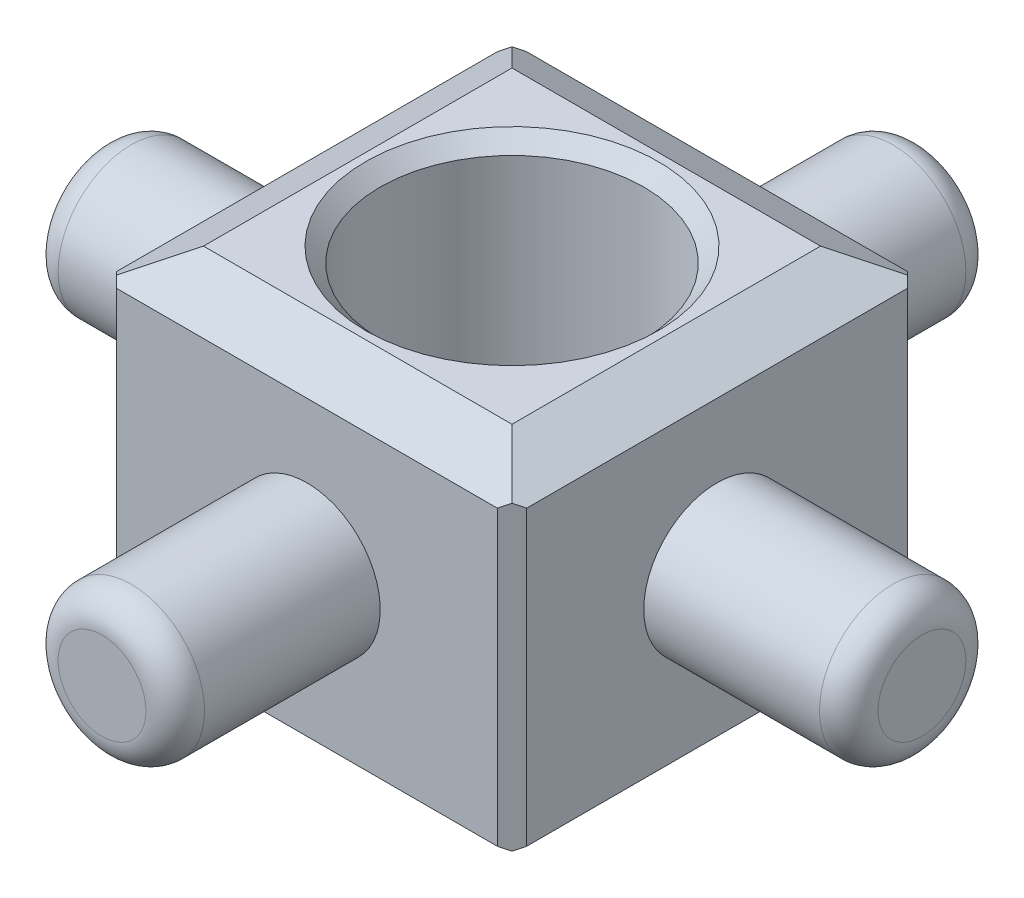
ISO-10303-21;
HEADER;
FILE_DESCRIPTION(('STEP AP214'),'2;1');
FILE_NAME('part.step','',(''),(''),'','','');
FILE_SCHEMA(('AUTOMOTIVE_DESIGN { 1 0 10303 214 1 1 1 1 }'));
ENDSEC;
DATA;
#1=APPLICATION_CONTEXT('core data for automotive mechanical design processes');
#2=APPLICATION_PROTOCOL_DEFINITION('international standard','automotive_design',2000,#1);
#3=PRODUCT_CONTEXT('',#1,'mechanical');
#4=PRODUCT('Part','Part','',(#3));
#5=PRODUCT_RELATED_PRODUCT_CATEGORY('part','',(#4));
#6=PRODUCT_DEFINITION_FORMATION('','',#4);
#7=PRODUCT_DEFINITION_CONTEXT('part definition',#1,'design');
#8=PRODUCT_DEFINITION('design','',#6,#7);
#9=PRODUCT_DEFINITION_SHAPE('','',#8);
#10=(LENGTH_UNIT() NAMED_UNIT(*) SI_UNIT(.MILLI.,.METRE.));
#11=(NAMED_UNIT(*) PLANE_ANGLE_UNIT() SI_UNIT($,.RADIAN.));
#12=(NAMED_UNIT(*) SI_UNIT($,.STERADIAN.) SOLID_ANGLE_UNIT());
#13=UNCERTAINTY_MEASURE_WITH_UNIT(LENGTH_MEASURE(1.E-05),#10,'distance_accuracy_value','');
#14=(GEOMETRIC_REPRESENTATION_CONTEXT(3) GLOBAL_UNCERTAINTY_ASSIGNED_CONTEXT((#13)) GLOBAL_UNIT_ASSIGNED_CONTEXT((#10,
#11,#12)) REPRESENTATION_CONTEXT('',''));
#15=CARTESIAN_POINT('',(0.,0.,0.));
#16=DIRECTION('',(0.,0.,1.));
#17=DIRECTION('',(1.,0.,0.));
#18=AXIS2_PLACEMENT_3D('',#15,#16,#17);
#19=CARTESIAN_POINT('',(-3.5,6.,-3.5));
#20=DIRECTION('',(0.,0.,1.));
#21=DIRECTION('',(1.,0.,0.));
#22=AXIS2_PLACEMENT_3D('',#19,#20,#21);
#23=PLANE('',#22);
#24=DIRECTION('',(0.,-1.,0.));
#25=VECTOR('',#24,1.);
#26=CARTESIAN_POINT('',(3.25,6.,-3.5));
#27=LINE('',#26,#25);
#28=CARTESIAN_POINT('',(3.25,5.5,-3.5));
#29=VERTEX_POINT('',#28);
#30=CARTESIAN_POINT('',(3.25,0.500000000000002,-3.5));
#31=VERTEX_POINT('',#30);
#32=EDGE_CURVE('E170',#29,#31,#27,.T.);
#33=ORIENTED_EDGE('',*,*,#32,.T.);
#34=DIRECTION('',(-1.,0.,0.));
#35=VECTOR('',#34,1.);
#36=CARTESIAN_POINT('',(-3.5,0.500000000000002,-3.5));
#37=LINE('',#36,#35);
#38=CARTESIAN_POINT('',(-3.25,0.500000000000002,-3.5));
#39=VERTEX_POINT('',#38);
#40=EDGE_CURVE('E211',#31,#39,#37,.T.);
#41=ORIENTED_EDGE('',*,*,#40,.T.);
#42=DIRECTION('',(0.,1.,0.));
#43=VECTOR('',#42,1.);
#44=CARTESIAN_POINT('',(-3.25,6.,-3.5));
#45=LINE('',#44,#43);
#46=CARTESIAN_POINT('',(-3.25,5.5,-3.5));
#47=VERTEX_POINT('',#46);
#48=EDGE_CURVE('E298',#39,#47,#45,.T.);
#49=ORIENTED_EDGE('',*,*,#48,.T.);
#50=DIRECTION('',(1.,0.,0.));
#51=VECTOR('',#50,1.);
#52=CARTESIAN_POINT('',(3.24999999999999,5.5,-3.5));
#53=LINE('',#52,#51);
#54=EDGE_CURVE('E209',#47,#29,#53,.T.);
#55=ORIENTED_EDGE('',*,*,#54,.T.);
#56=EDGE_LOOP('',(#33,#41,#49,#55));
#57=FACE_BOUND('',#56,.T.);
#58=CARTESIAN_POINT('',(0.,3.,-3.5));
#59=DIRECTION('',(0.,0.,1.));
#60=DIRECTION('',(1.,0.,0.));
#61=AXIS2_PLACEMENT_3D('',#58,#59,#60);
#62=CIRCLE('',#61,1.25);
#63=CARTESIAN_POINT('',(1.25000000000004,3.,-3.5));
#64=VERTEX_POINT('',#63);
#65=EDGE_CURVE('E334',#64,#64,#62,.F.);
#66=ORIENTED_EDGE('',*,*,#65,.F.);
#67=EDGE_LOOP('',(#66));
#68=FACE_BOUND('',#67,.T.);
#69=ADVANCED_FACE('F31',(#57,#68),#23,.F.);
#70=CARTESIAN_POINT('',(-3.5,6.,-3.5));
#71=DIRECTION('',(1.,0.,0.));
#72=DIRECTION('',(0.,0.,-1.));
#73=AXIS2_PLACEMENT_3D('',#70,#71,#72);
#74=PLANE('',#73);
#75=DIRECTION('',(0.,-1.,0.));
#76=VECTOR('',#75,1.);
#77=CARTESIAN_POINT('',(-3.5,6.,-3.25));
#78=LINE('',#77,#76);
#79=CARTESIAN_POINT('',(-3.5,5.5,-3.25));
#80=VERTEX_POINT('',#79);
#81=CARTESIAN_POINT('',(-3.5,0.500000000000003,-3.25));
#82=VERTEX_POINT('',#81);
#83=EDGE_CURVE('E154',#80,#82,#78,.T.);
#84=ORIENTED_EDGE('',*,*,#83,.T.);
#85=DIRECTION('',(0.,0.,1.));
#86=VECTOR('',#85,1.);
#87=CARTESIAN_POINT('',(-3.5,0.500000000000002,-3.5));
#88=LINE('',#87,#86);
#89=CARTESIAN_POINT('',(-3.5,0.500000000000002,3.25));
#90=VERTEX_POINT('',#89);
#91=EDGE_CURVE('E161',#82,#90,#88,.T.);
#92=ORIENTED_EDGE('',*,*,#91,.T.);
#93=DIRECTION('',(0.,1.,0.));
#94=VECTOR('',#93,1.);
#95=CARTESIAN_POINT('',(-3.5,6.,3.25));
#96=LINE('',#95,#94);
#97=CARTESIAN_POINT('',(-3.5,5.5,3.25));
#98=VERTEX_POINT('',#97);
#99=EDGE_CURVE('E157',#90,#98,#96,.T.);
#100=ORIENTED_EDGE('',*,*,#99,.T.);
#101=DIRECTION('',(0.,0.,-1.));
#102=VECTOR('',#101,1.);
#103=CARTESIAN_POINT('',(-3.5,5.5,-3.25));
#104=LINE('',#103,#102);
#105=EDGE_CURVE('E149',#98,#80,#104,.T.);
#106=ORIENTED_EDGE('',*,*,#105,.T.);
#107=EDGE_LOOP('',(#84,#92,#100,#106));
#108=FACE_BOUND('',#107,.T.);
#109=CARTESIAN_POINT('',(-3.5,3.,0.));
#110=DIRECTION('',(1.,0.,0.));
#111=DIRECTION('',(0.,0.,-1.));
#112=AXIS2_PLACEMENT_3D('',#109,#110,#111);
#113=CIRCLE('',#112,1.25);
#114=CARTESIAN_POINT('',(-3.5,3.,-1.25000000000002));
#115=VERTEX_POINT('',#114);
#116=EDGE_CURVE('E337',#115,#115,#113,.F.);
#117=ORIENTED_EDGE('',*,*,#116,.F.);
#118=EDGE_LOOP('',(#117));
#119=FACE_BOUND('',#118,.T.);
#120=ADVANCED_FACE('F151',(#108,#119),#74,.F.);
#121=CARTESIAN_POINT('',(-3.5,6.,3.5));
#122=DIRECTION('',(0.,0.,-1.));
#123=DIRECTION('',(-1.,0.,0.));
#124=AXIS2_PLACEMENT_3D('',#121,#122,#123);
#125=PLANE('',#124);
#126=DIRECTION('',(0.,-1.,0.));
#127=VECTOR('',#126,1.);
#128=CARTESIAN_POINT('',(-3.25,6.,3.5));
#129=LINE('',#128,#127);
#130=CARTESIAN_POINT('',(-3.25,5.5,3.5));
#131=VERTEX_POINT('',#130);
#132=CARTESIAN_POINT('',(-3.25,0.500000000000002,3.5));
#133=VERTEX_POINT('',#132);
#134=EDGE_CURVE('E283',#131,#133,#129,.T.);
#135=ORIENTED_EDGE('',*,*,#134,.T.);
#136=DIRECTION('',(1.,0.,0.));
#137=VECTOR('',#136,1.);
#138=CARTESIAN_POINT('',(-3.5,0.500000000000002,3.5));
#139=LINE('',#138,#137);
#140=CARTESIAN_POINT('',(3.25,0.500000000000002,3.5));
#141=VERTEX_POINT('',#140);
#142=EDGE_CURVE('E187',#133,#141,#139,.T.);
#143=ORIENTED_EDGE('',*,*,#142,.T.);
#144=DIRECTION('',(0.,1.,0.));
#145=VECTOR('',#144,1.);
#146=CARTESIAN_POINT('',(3.25,6.,3.5));
#147=LINE('',#146,#145);
#148=CARTESIAN_POINT('',(3.25,5.5,3.5));
#149=VERTEX_POINT('',#148);
#150=EDGE_CURVE('E162',#141,#149,#147,.T.);
#151=ORIENTED_EDGE('',*,*,#150,.T.);
#152=DIRECTION('',(-1.,0.,0.));
#153=VECTOR('',#152,1.);
#154=CARTESIAN_POINT('',(-3.25,5.5,3.5));
#155=LINE('',#154,#153);
#156=EDGE_CURVE('E184',#149,#131,#155,.T.);
#157=ORIENTED_EDGE('',*,*,#156,.T.);
#158=EDGE_LOOP('',(#135,#143,#151,#157));
#159=FACE_BOUND('',#158,.T.);
#160=CARTESIAN_POINT('',(0.,3.,3.5));
#161=DIRECTION('',(0.,0.,-1.));
#162=DIRECTION('',(-1.,0.,0.));
#163=AXIS2_PLACEMENT_3D('',#160,#161,#162);
#164=CIRCLE('',#163,1.25);
#165=CARTESIAN_POINT('',(-1.25000000000001,3.,3.5));
#166=VERTEX_POINT('',#165);
#167=EDGE_CURVE('E340',#166,#166,#164,.F.);
#168=ORIENTED_EDGE('',*,*,#167,.F.);
#169=EDGE_LOOP('',(#168));
#170=FACE_BOUND('',#169,.T.);
#171=ADVANCED_FACE('F285',(#159,#170),#125,.F.);
#172=CARTESIAN_POINT('',(3.5,6.,-3.5));
#173=DIRECTION('',(-1.,0.,0.));
#174=DIRECTION('',(0.,0.,1.));
#175=AXIS2_PLACEMENT_3D('',#172,#173,#174);
#176=PLANE('',#175);
#177=DIRECTION('',(0.,-1.,0.));
#178=VECTOR('',#177,1.);
#179=CARTESIAN_POINT('',(3.5,6.,3.25));
#180=LINE('',#179,#178);
#181=CARTESIAN_POINT('',(3.5,5.5,3.25));
#182=VERTEX_POINT('',#181);
#183=CARTESIAN_POINT('',(3.5,0.500000000000003,3.25));
#184=VERTEX_POINT('',#183);
#185=EDGE_CURVE('E293',#182,#184,#180,.T.);
#186=ORIENTED_EDGE('',*,*,#185,.T.);
#187=DIRECTION('',(0.,0.,-1.));
#188=VECTOR('',#187,1.);
#189=CARTESIAN_POINT('',(3.5,0.500000000000002,-3.5));
#190=LINE('',#189,#188);
#191=CARTESIAN_POINT('',(3.5,0.500000000000002,-3.25));
#192=VERTEX_POINT('',#191);
#193=EDGE_CURVE('E199',#184,#192,#190,.T.);
#194=ORIENTED_EDGE('',*,*,#193,.T.);
#195=DIRECTION('',(0.,1.,0.));
#196=VECTOR('',#195,1.);
#197=CARTESIAN_POINT('',(3.5,6.,-3.25));
#198=LINE('',#197,#196);
#199=CARTESIAN_POINT('',(3.5,5.5,-3.25));
#200=VERTEX_POINT('',#199);
#201=EDGE_CURVE('E289',#192,#200,#198,.T.);
#202=ORIENTED_EDGE('',*,*,#201,.T.);
#203=DIRECTION('',(0.,0.,1.));
#204=VECTOR('',#203,1.);
#205=CARTESIAN_POINT('',(3.5,5.5,3.25));
#206=LINE('',#205,#204);
#207=EDGE_CURVE('E197',#200,#182,#206,.T.);
#208=ORIENTED_EDGE('',*,*,#207,.T.);
#209=EDGE_LOOP('',(#186,#194,#202,#208));
#210=FACE_BOUND('',#209,.T.);
#211=CARTESIAN_POINT('',(3.5,3.,0.));
#212=DIRECTION('',(-1.,0.,0.));
#213=DIRECTION('',(0.,0.,1.));
#214=AXIS2_PLACEMENT_3D('',#211,#212,#213);
#215=CIRCLE('',#214,1.25);
#216=CARTESIAN_POINT('',(3.5,3.,1.25));
#217=VERTEX_POINT('',#216);
#218=EDGE_CURVE('E228',#217,#217,#215,.F.);
#219=ORIENTED_EDGE('',*,*,#218,.F.);
#220=EDGE_LOOP('',(#219));
#221=FACE_BOUND('',#220,.T.);
#222=ADVANCED_FACE('F354',(#210,#221),#176,.F.);
#223=CARTESIAN_POINT('',(-3.5,6.,3.5));
#224=DIRECTION('',(0.,1.,0.));
#225=DIRECTION('',(0.,0.,1.));
#226=AXIS2_PLACEMENT_3D('',#223,#224,#225);
#227=PLANE('',#226);
#228=DIRECTION('',(0.,0.,1.));
#229=VECTOR('',#228,1.);
#230=CARTESIAN_POINT('',(-2.63397459621556,6.,3.25));
#231=LINE('',#230,#229);
#232=CARTESIAN_POINT('',(-2.63397459621556,6.,-2.63397459621556));
#233=VERTEX_POINT('',#232);
#234=CARTESIAN_POINT('',(-2.63397459621556,6.,2.63397459621556));
#235=VERTEX_POINT('',#234);
#236=EDGE_CURVE('E55',#233,#235,#231,.T.);
#237=ORIENTED_EDGE('',*,*,#236,.T.);
#238=DIRECTION('',(1.,0.,0.));
#239=VECTOR('',#238,1.);
#240=CARTESIAN_POINT('',(3.25,6.,2.63397459621556));
#241=LINE('',#240,#239);
#242=CARTESIAN_POINT('',(2.63397459621556,6.,2.63397459621556));
#243=VERTEX_POINT('',#242);
#244=EDGE_CURVE('E11',#235,#243,#241,.T.);
#245=ORIENTED_EDGE('',*,*,#244,.T.);
#246=DIRECTION('',(0.,0.,-1.));
#247=VECTOR('',#246,1.);
#248=CARTESIAN_POINT('',(2.63397459621556,6.,-3.25));
#249=LINE('',#248,#247);
#250=CARTESIAN_POINT('',(2.63397459621556,6.,-2.63397459621556));
#251=VERTEX_POINT('',#250);
#252=EDGE_CURVE('E40',#243,#251,#249,.T.);
#253=ORIENTED_EDGE('',*,*,#252,.T.);
#254=DIRECTION('',(-1.,0.,0.));
#255=VECTOR('',#254,1.);
#256=CARTESIAN_POINT('',(-3.25,6.,-2.63397459621556));
#257=LINE('',#256,#255);
#258=EDGE_CURVE('E213',#251,#233,#257,.T.);
#259=ORIENTED_EDGE('',*,*,#258,.T.);
#260=EDGE_LOOP('',(#237,#245,#253,#259));
#261=FACE_BOUND('',#260,.T.);
#262=CARTESIAN_POINT('',(0.,6.,0.));
#263=DIRECTION('',(0.,1.,0.));
#264=DIRECTION('',(0.,0.,1.));
#265=AXIS2_PLACEMENT_3D('',#262,#263,#264);
#266=CIRCLE('',#265,2.5);
#267=CARTESIAN_POINT('',(0.,6.,2.5));
#268=VERTEX_POINT('',#267);
#269=EDGE_CURVE('E304',#268,#268,#266,.F.);
#270=ORIENTED_EDGE('',*,*,#269,.T.);
#271=EDGE_LOOP('',(#270));
#272=FACE_BOUND('',#271,.T.);
#273=ADVANCED_FACE('F243',(#261,#272),#227,.T.);
#274=CARTESIAN_POINT('',(-3.5,0.,3.5));
#275=DIRECTION('',(0.,1.,0.));
#276=DIRECTION('',(0.,0.,1.));
#277=AXIS2_PLACEMENT_3D('',#274,#275,#276);
#278=PLANE('',#277);
#279=DIRECTION('',(-1.,0.,0.));
#280=VECTOR('',#279,1.);
#281=CARTESIAN_POINT('',(-3.5,0.,2.63397459621556));
#282=LINE('',#281,#280);
#283=CARTESIAN_POINT('',(2.63397459621556,0.,2.63397459621556));
#284=VERTEX_POINT('',#283);
#285=CARTESIAN_POINT('',(-2.63397459621556,0.,2.63397459621556));
#286=VERTEX_POINT('',#285);
#287=EDGE_CURVE('E262',#284,#286,#282,.T.);
#288=ORIENTED_EDGE('',*,*,#287,.T.);
#289=DIRECTION('',(0.,0.,-1.));
#290=VECTOR('',#289,1.);
#291=CARTESIAN_POINT('',(-2.63397459621556,0.,3.5));
#292=LINE('',#291,#290);
#293=CARTESIAN_POINT('',(-2.63397459621556,0.,-2.63397459621556));
#294=VERTEX_POINT('',#293);
#295=EDGE_CURVE('E179',#286,#294,#292,.T.);
#296=ORIENTED_EDGE('',*,*,#295,.T.);
#297=DIRECTION('',(1.,0.,0.));
#298=VECTOR('',#297,1.);
#299=CARTESIAN_POINT('',(-3.5,0.,-2.63397459621556));
#300=LINE('',#299,#298);
#301=CARTESIAN_POINT('',(2.63397459621556,0.,-2.63397459621556));
#302=VERTEX_POINT('',#301);
#303=EDGE_CURVE('E258',#294,#302,#300,.T.);
#304=ORIENTED_EDGE('',*,*,#303,.T.);
#305=DIRECTION('',(0.,0.,1.));
#306=VECTOR('',#305,1.);
#307=CARTESIAN_POINT('',(2.63397459621556,0.,3.5));
#308=LINE('',#307,#306);
#309=EDGE_CURVE('E260',#302,#284,#308,.T.);
#310=ORIENTED_EDGE('',*,*,#309,.T.);
#311=EDGE_LOOP('',(#288,#296,#304,#310));
#312=FACE_BOUND('',#311,.T.);
#313=CARTESIAN_POINT('',(0.,0.,0.));
#314=DIRECTION('',(0.,1.,0.));
#315=DIRECTION('',(0.,0.,1.));
#316=AXIS2_PLACEMENT_3D('',#313,#314,#315);
#317=CIRCLE('',#316,2.5);
#318=CARTESIAN_POINT('',(0.,0.,2.5));
#319=VERTEX_POINT('',#318);
#320=EDGE_CURVE('E313',#319,#319,#317,.T.);
#321=ORIENTED_EDGE('',*,*,#320,.T.);
#322=EDGE_LOOP('',(#321));
#323=FACE_BOUND('',#322,.T.);
#324=ADVANCED_FACE('F266',(#312,#323),#278,.F.);
#325=CARTESIAN_POINT('',(0.,0.,0.));
#326=DIRECTION('',(0.,1.,0.));
#327=DIRECTION('',(0.,0.,1.));
#328=AXIS2_PLACEMENT_3D('',#325,#326,#327);
#329=CYLINDRICAL_SURFACE('',#328,2.25);
#330=CARTESIAN_POINT('',(0.,0.250000000000004,0.));
#331=DIRECTION('',(0.,1.,0.));
#332=DIRECTION('',(0.,0.,1.));
#333=AXIS2_PLACEMENT_3D('',#330,#331,#332);
#334=CIRCLE('',#333,2.25);
#335=CARTESIAN_POINT('',(0.,0.250000000000004,2.25));
#336=VERTEX_POINT('',#335);
#337=EDGE_CURVE('E307',#336,#336,#334,.F.);
#338=ORIENTED_EDGE('',*,*,#337,.T.);
#339=EDGE_LOOP('',(#338));
#340=FACE_BOUND('',#339,.T.);
#341=CARTESIAN_POINT('',(0.,5.75,0.));
#342=DIRECTION('',(0.,1.,0.));
#343=DIRECTION('',(0.,0.,1.));
#344=AXIS2_PLACEMENT_3D('',#341,#342,#343);
#345=CIRCLE('',#344,2.25);
#346=CARTESIAN_POINT('',(0.,5.75,2.25));
#347=VERTEX_POINT('',#346);
#348=EDGE_CURVE('E310',#347,#347,#345,.T.);
#349=ORIENTED_EDGE('',*,*,#348,.T.);
#350=EDGE_LOOP('',(#349));
#351=FACE_BOUND('',#350,.T.);
#352=ADVANCED_FACE('F374',(#340,#351),#329,.F.);
#353=CARTESIAN_POINT('',(7.,3.,0.));
#354=DIRECTION('',(-1.,0.,0.));
#355=DIRECTION('',(0.,0.,1.));
#356=AXIS2_PLACEMENT_3D('',#353,#354,#355);
#357=CYLINDRICAL_SURFACE('',#356,1.25);
#358=CARTESIAN_POINT('',(6.5,3.,0.));
#359=DIRECTION('',(1.,0.,0.));
#360=DIRECTION('',(0.,0.,-1.));
#361=AXIS2_PLACEMENT_3D('',#358,#359,#360);
#362=CIRCLE('',#361,1.25);
#363=CARTESIAN_POINT('',(6.5,3.,-1.25));
#364=VERTEX_POINT('',#363);
#365=EDGE_CURVE('E343',#364,#364,#362,.F.);
#366=ORIENTED_EDGE('',*,*,#365,.T.);
#367=EDGE_LOOP('',(#366));
#368=FACE_BOUND('',#367,.T.);
#369=ORIENTED_EDGE('',*,*,#218,.T.);
#370=EDGE_LOOP('',(#369));
#371=FACE_BOUND('',#370,.T.);
#372=ADVANCED_FACE('F352',(#368,#371),#357,.T.);
#373=CARTESIAN_POINT('',(7.,3.,0.));
#374=DIRECTION('',(1.,0.,0.));
#375=DIRECTION('',(0.,0.,-1.));
#376=AXIS2_PLACEMENT_3D('',#373,#374,#375);
#377=PLANE('',#376);
#378=CARTESIAN_POINT('',(7.,3.,0.));
#379=DIRECTION('',(1.,0.,0.));
#380=DIRECTION('',(0.,0.,-1.));
#381=AXIS2_PLACEMENT_3D('',#378,#379,#380);
#382=CIRCLE('',#381,0.75);
#383=CARTESIAN_POINT('',(7.,3.,-0.750000000000001));
#384=VERTEX_POINT('',#383);
#385=EDGE_CURVE('E346',#384,#384,#382,.T.);
#386=ORIENTED_EDGE('',*,*,#385,.T.);
#387=EDGE_LOOP('',(#386));
#388=FACE_BOUND('',#387,.T.);
#389=ADVANCED_FACE('F381',(#388),#377,.T.);
#390=CARTESIAN_POINT('',(6.5,3.,0.));
#391=DIRECTION('',(1.,0.,0.));
#392=DIRECTION('',(0.,0.,-1.));
#393=AXIS2_PLACEMENT_3D('',#390,#391,#392);
#394=TOROIDAL_SURFACE('',#393,0.75,0.5);
#395=ORIENTED_EDGE('',*,*,#365,.F.);
#396=EDGE_LOOP('',(#395));
#397=FACE_BOUND('',#396,.T.);
#398=ORIENTED_EDGE('',*,*,#385,.F.);
#399=EDGE_LOOP('',(#398));
#400=FACE_BOUND('',#399,.T.);
#401=ADVANCED_FACE('F385',(#397,#400),#394,.T.);
#402=CARTESIAN_POINT('',(0.,3.,7.));
#403=DIRECTION('',(0.,0.,-1.));
#404=DIRECTION('',(-1.,0.,0.));
#405=AXIS2_PLACEMENT_3D('',#402,#403,#404);
#406=CYLINDRICAL_SURFACE('',#405,1.25);
#407=CARTESIAN_POINT('',(0.,3.,6.5));
#408=DIRECTION('',(0.,0.,1.));
#409=DIRECTION('',(1.,0.,0.));
#410=AXIS2_PLACEMENT_3D('',#407,#408,#409);
#411=CIRCLE('',#410,1.25);
#412=CARTESIAN_POINT('',(1.24999999999998,3.,6.5));
#413=VERTEX_POINT('',#412);
#414=EDGE_CURVE('E328',#413,#413,#411,.F.);
#415=ORIENTED_EDGE('',*,*,#414,.T.);
#416=EDGE_LOOP('',(#415));
#417=FACE_BOUND('',#416,.T.);
#418=ORIENTED_EDGE('',*,*,#167,.T.);
#419=EDGE_LOOP('',(#418));
#420=FACE_BOUND('',#419,.T.);
#421=ADVANCED_FACE('F387',(#417,#420),#406,.T.);
#422=CARTESIAN_POINT('',(0.,3.,7.));
#423=DIRECTION('',(0.,0.,1.));
#424=DIRECTION('',(1.,0.,0.));
#425=AXIS2_PLACEMENT_3D('',#422,#423,#424);
#426=PLANE('',#425);
#427=CARTESIAN_POINT('',(0.,3.,7.));
#428=DIRECTION('',(0.,0.,1.));
#429=DIRECTION('',(1.,0.,0.));
#430=AXIS2_PLACEMENT_3D('',#427,#428,#429);
#431=CIRCLE('',#430,0.75);
#432=CARTESIAN_POINT('',(0.749999999999976,3.,7.));
#433=VERTEX_POINT('',#432);
#434=EDGE_CURVE('E331',#433,#433,#431,.T.);
#435=ORIENTED_EDGE('',*,*,#434,.T.);
#436=EDGE_LOOP('',(#435));
#437=FACE_BOUND('',#436,.T.);
#438=ADVANCED_FACE('F390',(#437),#426,.T.);
#439=CARTESIAN_POINT('',(-7.,3.,0.));
#440=DIRECTION('',(1.,0.,0.));
#441=DIRECTION('',(0.,0.,-1.));
#442=AXIS2_PLACEMENT_3D('',#439,#440,#441);
#443=CYLINDRICAL_SURFACE('',#442,1.25);
#444=CARTESIAN_POINT('',(-6.5,3.,0.));
#445=DIRECTION('',(-1.,0.,0.));
#446=DIRECTION('',(0.,0.,1.));
#447=AXIS2_PLACEMENT_3D('',#444,#445,#446);
#448=CIRCLE('',#447,1.25);
#449=CARTESIAN_POINT('',(-6.50000000000001,3.,1.24999999999996));
#450=VERTEX_POINT('',#449);
#451=EDGE_CURVE('E322',#450,#450,#448,.F.);
#452=ORIENTED_EDGE('',*,*,#451,.T.);
#453=EDGE_LOOP('',(#452));
#454=FACE_BOUND('',#453,.T.);
#455=ORIENTED_EDGE('',*,*,#116,.T.);
#456=EDGE_LOOP('',(#455));
#457=FACE_BOUND('',#456,.T.);
#458=ADVANCED_FACE('F394',(#454,#457),#443,.T.);
#459=CARTESIAN_POINT('',(-7.,3.,0.));
#460=DIRECTION('',(-1.,0.,0.));
#461=DIRECTION('',(0.,0.,1.));
#462=AXIS2_PLACEMENT_3D('',#459,#460,#461);
#463=PLANE('',#462);
#464=CARTESIAN_POINT('',(-7.,3.,0.));
#465=DIRECTION('',(-1.,0.,0.));
#466=DIRECTION('',(0.,0.,1.));
#467=AXIS2_PLACEMENT_3D('',#464,#465,#466);
#468=CIRCLE('',#467,0.75);
#469=CARTESIAN_POINT('',(-7.,3.,0.749999999999952));
#470=VERTEX_POINT('',#469);
#471=EDGE_CURVE('E325',#470,#470,#468,.T.);
#472=ORIENTED_EDGE('',*,*,#471,.T.);
#473=EDGE_LOOP('',(#472));
#474=FACE_BOUND('',#473,.T.);
#475=ADVANCED_FACE('F398',(#474),#463,.T.);
#476=CARTESIAN_POINT('',(0.,3.,-7.));
#477=DIRECTION('',(0.,0.,1.));
#478=DIRECTION('',(1.,0.,0.));
#479=AXIS2_PLACEMENT_3D('',#476,#477,#478);
#480=CYLINDRICAL_SURFACE('',#479,1.25);
#481=CARTESIAN_POINT('',(0.,3.,-6.5));
#482=DIRECTION('',(0.,0.,-1.));
#483=DIRECTION('',(-1.,0.,0.));
#484=AXIS2_PLACEMENT_3D('',#481,#482,#483);
#485=CIRCLE('',#484,1.25);
#486=CARTESIAN_POINT('',(-1.24999999999993,3.,-6.50000000000001));
#487=VERTEX_POINT('',#486);
#488=EDGE_CURVE('E316',#487,#487,#485,.F.);
#489=ORIENTED_EDGE('',*,*,#488,.T.);
#490=EDGE_LOOP('',(#489));
#491=FACE_BOUND('',#490,.T.);
#492=ORIENTED_EDGE('',*,*,#65,.T.);
#493=EDGE_LOOP('',(#492));
#494=FACE_BOUND('',#493,.T.);
#495=ADVANCED_FACE('F402',(#491,#494),#480,.T.);
#496=CARTESIAN_POINT('',(0.,3.,-7.));
#497=DIRECTION('',(0.,0.,-1.));
#498=DIRECTION('',(-1.,0.,0.));
#499=AXIS2_PLACEMENT_3D('',#496,#497,#498);
#500=PLANE('',#499);
#501=CARTESIAN_POINT('',(0.,3.,-7.));
#502=DIRECTION('',(0.,0.,-1.));
#503=DIRECTION('',(-1.,0.,0.));
#504=AXIS2_PLACEMENT_3D('',#501,#502,#503);
#505=CIRCLE('',#504,0.75);
#506=CARTESIAN_POINT('',(-0.749999999999927,3.,-7.00000000000001));
#507=VERTEX_POINT('',#506);
#508=EDGE_CURVE('E319',#507,#507,#505,.T.);
#509=ORIENTED_EDGE('',*,*,#508,.T.);
#510=EDGE_LOOP('',(#509));
#511=FACE_BOUND('',#510,.T.);
#512=ADVANCED_FACE('F406',(#511),#500,.T.);
#513=CARTESIAN_POINT('',(0.,3.,6.5));
#514=DIRECTION('',(0.,0.,1.));
#515=DIRECTION('',(1.,0.,0.));
#516=AXIS2_PLACEMENT_3D('',#513,#514,#515);
#517=TOROIDAL_SURFACE('',#516,0.75,0.5);
#518=ORIENTED_EDGE('',*,*,#414,.F.);
#519=EDGE_LOOP('',(#518));
#520=FACE_BOUND('',#519,.T.);
#521=ORIENTED_EDGE('',*,*,#434,.F.);
#522=EDGE_LOOP('',(#521));
#523=FACE_BOUND('',#522,.T.);
#524=ADVANCED_FACE('F409',(#520,#523),#517,.T.);
#525=CARTESIAN_POINT('',(-6.5,3.,0.));
#526=DIRECTION('',(-1.,0.,0.));
#527=DIRECTION('',(0.,0.,1.));
#528=AXIS2_PLACEMENT_3D('',#525,#526,#527);
#529=TOROIDAL_SURFACE('',#528,0.75,0.5);
#530=ORIENTED_EDGE('',*,*,#451,.F.);
#531=EDGE_LOOP('',(#530));
#532=FACE_BOUND('',#531,.T.);
#533=ORIENTED_EDGE('',*,*,#471,.F.);
#534=EDGE_LOOP('',(#533));
#535=FACE_BOUND('',#534,.T.);
#536=ADVANCED_FACE('F414',(#532,#535),#529,.T.);
#537=CARTESIAN_POINT('',(0.,3.,-6.5));
#538=DIRECTION('',(0.,0.,-1.));
#539=DIRECTION('',(-1.,0.,0.));
#540=AXIS2_PLACEMENT_3D('',#537,#538,#539);
#541=TOROIDAL_SURFACE('',#540,0.75,0.5);
#542=ORIENTED_EDGE('',*,*,#488,.F.);
#543=EDGE_LOOP('',(#542));
#544=FACE_BOUND('',#543,.T.);
#545=ORIENTED_EDGE('',*,*,#508,.F.);
#546=EDGE_LOOP('',(#545));
#547=FACE_BOUND('',#546,.T.);
#548=ADVANCED_FACE('F419',(#544,#547),#541,.T.);
#549=CARTESIAN_POINT('',(0.,0.,0.));
#550=DIRECTION('',(0.,-1.,0.));
#551=DIRECTION('',(0.,0.,-1.));
#552=AXIS2_PLACEMENT_3D('',#549,#550,#551);
#553=CONICAL_SURFACE('',#552,2.5,0.785398163397442);
#554=ORIENTED_EDGE('',*,*,#337,.F.);
#555=EDGE_LOOP('',(#554));
#556=FACE_BOUND('',#555,.T.);
#557=ORIENTED_EDGE('',*,*,#320,.F.);
#558=EDGE_LOOP('',(#557));
#559=FACE_BOUND('',#558,.T.);
#560=ADVANCED_FACE('F421',(#556,#559),#553,.F.);
#561=CARTESIAN_POINT('',(0.,5.75,0.));
#562=DIRECTION('',(0.,1.,0.));
#563=DIRECTION('',(0.,0.,1.));
#564=AXIS2_PLACEMENT_3D('',#561,#562,#563);
#565=CONICAL_SURFACE('',#564,2.25,0.785398163397454);
#566=ORIENTED_EDGE('',*,*,#269,.F.);
#567=EDGE_LOOP('',(#566));
#568=FACE_BOUND('',#567,.T.);
#569=ORIENTED_EDGE('',*,*,#348,.F.);
#570=EDGE_LOOP('',(#569));
#571=FACE_BOUND('',#570,.T.);
#572=ADVANCED_FACE('F428',(#568,#571),#565,.F.);
#573=CARTESIAN_POINT('',(-3.5,6.,-3.25));
#574=DIRECTION('',(0.707106781186547,0.,0.707106781186547));
#575=DIRECTION('',(0.707106781186548,0.,-0.707106781186548));
#576=AXIS2_PLACEMENT_3D('',#573,#574,#575);
#577=PLANE('',#576);
#578=DIRECTION('',(-0.654653670707977,-0.377964473009228,0.654653670707977));
#579=VECTOR('',#578,1.);
#580=CARTESIAN_POINT('',(-2.10338865119588,1.16199637088794,-4.64661134880412));
#581=LINE('',#580,#579);
#582=CARTESIAN_POINT('',(-3.375,0.427831216351298,-3.375));
#583=VERTEX_POINT('',#582);
#584=EDGE_CURVE('E175',#39,#583,#581,.T.);
#585=ORIENTED_EDGE('',*,*,#584,.T.);
#586=DIRECTION('',(-0.654653670707977,0.377964473009228,0.654653670707977));
#587=VECTOR('',#586,1.);
#588=CARTESIAN_POINT('',(-4.86089706308984,1.28571428571429,-1.88910293691016));
#589=LINE('',#588,#587);
#590=EDGE_CURVE('E169',#583,#82,#589,.T.);
#591=ORIENTED_EDGE('',*,*,#590,.T.);
#592=ORIENTED_EDGE('',*,*,#83,.F.);
#593=DIRECTION('',(-0.654653670707977,-0.377964473009228,0.654653670707977));
#594=VECTOR('',#593,1.);
#595=CARTESIAN_POINT('',(-3.37628208517365,5.57142857142857,-3.37371791482635));
#596=LINE('',#595,#594);
#597=CARTESIAN_POINT('',(-3.375,5.5721687836487,-3.375));
#598=VERTEX_POINT('',#597);
#599=EDGE_CURVE('E166',#80,#598,#596,.F.);
#600=ORIENTED_EDGE('',*,*,#599,.T.);
#601=DIRECTION('',(-0.654653670707977,0.377964473009228,0.654653670707977));
#602=VECTOR('',#601,1.);
#603=CARTESIAN_POINT('',(-3.58800362911206,5.69514648625492,-3.16199637088793));
#604=LINE('',#603,#602);
#605=EDGE_CURVE('E176',#598,#47,#604,.F.);
#606=ORIENTED_EDGE('',*,*,#605,.T.);
#607=ORIENTED_EDGE('',*,*,#48,.F.);
#608=EDGE_LOOP('',(#585,#591,#592,#600,#606,#607));
#609=FACE_BOUND('',#608,.T.);
#610=ADVANCED_FACE('F165',(#609),#577,.F.);
#611=CARTESIAN_POINT('',(3.25,6.,-3.5));
#612=DIRECTION('',(-0.70710678118655,0.,0.707106781186545));
#613=DIRECTION('',(0.707106781186545,0.,0.70710678118655));
#614=AXIS2_PLACEMENT_3D('',#611,#612,#613);
#615=PLANE('',#614);
#616=ORIENTED_EDGE('',*,*,#201,.F.);
#617=DIRECTION('',(-0.654653670707975,-0.377964473009227,-0.654653670707979));
#618=VECTOR('',#617,1.);
#619=CARTESIAN_POINT('',(4.64661134880411,1.16199637088794,-2.10338865119588));
#620=LINE('',#619,#618);
#621=CARTESIAN_POINT('',(3.375,0.427831216351298,-3.375));
#622=VERTEX_POINT('',#621);
#623=EDGE_CURVE('E207',#192,#622,#620,.T.);
#624=ORIENTED_EDGE('',*,*,#623,.T.);
#625=DIRECTION('',(-0.654653670707974,0.37796447300923,-0.654653670707979));
#626=VECTOR('',#625,1.);
#627=CARTESIAN_POINT('',(1.88910293691016,1.2857142857143,-4.86089706308984));
#628=LINE('',#627,#626);
#629=EDGE_CURVE('E205',#622,#31,#628,.T.);
#630=ORIENTED_EDGE('',*,*,#629,.T.);
#631=ORIENTED_EDGE('',*,*,#32,.F.);
#632=DIRECTION('',(-0.654653670707974,-0.37796447300923,-0.654653670707979));
#633=VECTOR('',#632,1.);
#634=CARTESIAN_POINT('',(3.37371791482635,5.57142857142857,-3.37628208517365));
#635=LINE('',#634,#633);
#636=CARTESIAN_POINT('',(3.375,5.5721687836487,-3.375));
#637=VERTEX_POINT('',#636);
#638=EDGE_CURVE('E201',#29,#637,#635,.F.);
#639=ORIENTED_EDGE('',*,*,#638,.T.);
#640=DIRECTION('',(-0.654653670707975,0.377964473009227,-0.654653670707979));
#641=VECTOR('',#640,1.);
#642=CARTESIAN_POINT('',(3.16199637088794,5.69514648625492,-3.58800362911206));
#643=LINE('',#642,#641);
#644=EDGE_CURVE('E203',#637,#200,#643,.F.);
#645=ORIENTED_EDGE('',*,*,#644,.T.);
#646=EDGE_LOOP('',(#616,#624,#630,#631,#639,#645));
#647=FACE_BOUND('',#646,.T.);
#648=ADVANCED_FACE('F440',(#647),#615,.F.);
#649=CARTESIAN_POINT('',(3.5,6.,3.25));
#650=DIRECTION('',(-0.707106781186547,0.,-0.707106781186547));
#651=DIRECTION('',(-0.707106781186548,0.,0.707106781186548));
#652=AXIS2_PLACEMENT_3D('',#649,#650,#651);
#653=PLANE('',#652);
#654=ORIENTED_EDGE('',*,*,#150,.F.);
#655=DIRECTION('',(0.654653670707977,-0.377964473009228,-0.654653670707977));
#656=VECTOR('',#655,1.);
#657=CARTESIAN_POINT('',(2.10338865119588,1.16199637088794,4.64661134880412));
#658=LINE('',#657,#656);
#659=CARTESIAN_POINT('',(3.375,0.427831216351299,3.375));
#660=VERTEX_POINT('',#659);
#661=EDGE_CURVE('E195',#141,#660,#658,.T.);
#662=ORIENTED_EDGE('',*,*,#661,.T.);
#663=DIRECTION('',(0.654653670707977,0.377964473009228,-0.654653670707977));
#664=VECTOR('',#663,1.);
#665=CARTESIAN_POINT('',(4.86089706308984,1.28571428571429,1.88910293691016));
#666=LINE('',#665,#664);
#667=EDGE_CURVE('E193',#660,#184,#666,.T.);
#668=ORIENTED_EDGE('',*,*,#667,.T.);
#669=ORIENTED_EDGE('',*,*,#185,.F.);
#670=DIRECTION('',(0.654653670707977,-0.377964473009228,-0.654653670707977));
#671=VECTOR('',#670,1.);
#672=CARTESIAN_POINT('',(3.37628208517365,5.57142857142857,3.37371791482635));
#673=LINE('',#672,#671);
#674=CARTESIAN_POINT('',(3.375,5.5721687836487,3.375));
#675=VERTEX_POINT('',#674);
#676=EDGE_CURVE('E189',#182,#675,#673,.F.);
#677=ORIENTED_EDGE('',*,*,#676,.T.);
#678=DIRECTION('',(0.654653670707977,0.377964473009228,-0.654653670707977));
#679=VECTOR('',#678,1.);
#680=CARTESIAN_POINT('',(3.58800362911206,5.69514648625492,3.16199637088793));
#681=LINE('',#680,#679);
#682=EDGE_CURVE('E191',#675,#149,#681,.F.);
#683=ORIENTED_EDGE('',*,*,#682,.T.);
#684=EDGE_LOOP('',(#654,#662,#668,#669,#677,#683));
#685=FACE_BOUND('',#684,.T.);
#686=ADVANCED_FACE('F443',(#685),#653,.F.);
#687=CARTESIAN_POINT('',(-3.25,6.,3.5));
#688=DIRECTION('',(0.70710678118655,0.,-0.707106781186545));
#689=DIRECTION('',(-0.707106781186545,0.,-0.70710678118655));
#690=AXIS2_PLACEMENT_3D('',#687,#688,#689);
#691=PLANE('',#690);
#692=ORIENTED_EDGE('',*,*,#99,.F.);
#693=DIRECTION('',(0.654653670707975,-0.377964473009227,0.654653670707979));
#694=VECTOR('',#693,1.);
#695=CARTESIAN_POINT('',(-4.64661134880411,1.16199637088794,2.10338865119588));
#696=LINE('',#695,#694);
#697=CARTESIAN_POINT('',(-3.375,0.427831216351298,3.375));
#698=VERTEX_POINT('',#697);
#699=EDGE_CURVE('E256',#90,#698,#696,.T.);
#700=ORIENTED_EDGE('',*,*,#699,.T.);
#701=DIRECTION('',(0.654653670707974,0.37796447300923,0.654653670707979));
#702=VECTOR('',#701,1.);
#703=CARTESIAN_POINT('',(-1.88910293691017,1.2857142857143,4.86089706308984));
#704=LINE('',#703,#702);
#705=EDGE_CURVE('E251',#698,#133,#704,.T.);
#706=ORIENTED_EDGE('',*,*,#705,.T.);
#707=ORIENTED_EDGE('',*,*,#134,.F.);
#708=DIRECTION('',(0.654653670707974,-0.37796447300923,0.654653670707979));
#709=VECTOR('',#708,1.);
#710=CARTESIAN_POINT('',(-3.37371791482635,5.57142857142857,3.37628208517365));
#711=LINE('',#710,#709);
#712=CARTESIAN_POINT('',(-3.375,5.5721687836487,3.375));
#713=VERTEX_POINT('',#712);
#714=EDGE_CURVE('E247',#131,#713,#711,.F.);
#715=ORIENTED_EDGE('',*,*,#714,.T.);
#716=DIRECTION('',(0.654653670707975,0.377964473009227,0.654653670707979));
#717=VECTOR('',#716,1.);
#718=CARTESIAN_POINT('',(-3.16199637088794,5.69514648625492,3.58800362911206));
#719=LINE('',#718,#717);
#720=EDGE_CURVE('E248',#713,#98,#719,.F.);
#721=ORIENTED_EDGE('',*,*,#720,.T.);
#722=EDGE_LOOP('',(#692,#700,#706,#707,#715,#721));
#723=FACE_BOUND('',#722,.T.);
#724=ADVANCED_FACE('F282',(#723),#691,.F.);
#725=CARTESIAN_POINT('',(3.5,0.500000000000002,-3.5));
#726=DIRECTION('',(-0.500000000000001,0.866025403784438,0.));
#727=DIRECTION('',(-0.866025403784438,-0.500000000000001,0.));
#728=AXIS2_PLACEMENT_3D('',#725,#726,#727);
#729=PLANE('',#728);
#730=DIRECTION('',(-0.654653670707977,-0.377964473009228,-0.654653670707977));
#731=VECTOR('',#730,1.);
#732=CARTESIAN_POINT('',(0.500000000000003,-1.23205080756888,0.500000000000003));
#733=LINE('',#732,#731);
#734=EDGE_CURVE('E222',#284,#660,#733,.F.);
#735=ORIENTED_EDGE('',*,*,#734,.F.);
#736=ORIENTED_EDGE('',*,*,#309,.F.);
#737=DIRECTION('',(-0.654653670707977,-0.377964473009228,0.654653670707977));
#738=VECTOR('',#737,1.);
#739=CARTESIAN_POINT('',(0.500000000000002,-1.23205080756888,-0.500000000000002));
#740=LINE('',#739,#738);
#741=EDGE_CURVE('E225',#622,#302,#740,.T.);
#742=ORIENTED_EDGE('',*,*,#741,.F.);
#743=ORIENTED_EDGE('',*,*,#623,.F.);
#744=ORIENTED_EDGE('',*,*,#193,.F.);
#745=ORIENTED_EDGE('',*,*,#667,.F.);
#746=EDGE_LOOP('',(#735,#736,#742,#743,#744,#745));
#747=FACE_BOUND('',#746,.T.);
#748=ADVANCED_FACE('F450',(#747),#729,.F.);
#749=CARTESIAN_POINT('',(-3.5,0.500000000000002,-3.5));
#750=DIRECTION('',(0.,0.866025403784438,0.500000000000001));
#751=DIRECTION('',(0.,-0.500000000000001,0.866025403784438));
#752=AXIS2_PLACEMENT_3D('',#749,#750,#751);
#753=PLANE('',#752);
#754=ORIENTED_EDGE('',*,*,#741,.T.);
#755=ORIENTED_EDGE('',*,*,#303,.F.);
#756=DIRECTION('',(-0.654653670707977,0.377964473009228,-0.654653670707977));
#757=VECTOR('',#756,1.);
#758=CARTESIAN_POINT('',(-3.5,0.500000000000002,-3.5));
#759=LINE('',#758,#757);
#760=EDGE_CURVE('E220',#583,#294,#759,.F.);
#761=ORIENTED_EDGE('',*,*,#760,.F.);
#762=ORIENTED_EDGE('',*,*,#584,.F.);
#763=ORIENTED_EDGE('',*,*,#40,.F.);
#764=ORIENTED_EDGE('',*,*,#629,.F.);
#765=EDGE_LOOP('',(#754,#755,#761,#762,#763,#764));
#766=FACE_BOUND('',#765,.T.);
#767=ADVANCED_FACE('F455',(#766),#753,.F.);
#768=CARTESIAN_POINT('',(-3.5,0.500000000000002,3.5));
#769=DIRECTION('',(0.,0.866025403784438,-0.500000000000001));
#770=DIRECTION('',(0.,0.500000000000001,0.866025403784438));
#771=AXIS2_PLACEMENT_3D('',#768,#769,#770);
#772=PLANE('',#771);
#773=ORIENTED_EDGE('',*,*,#142,.F.);
#774=ORIENTED_EDGE('',*,*,#705,.F.);
#775=DIRECTION('',(0.654653670707977,-0.377964473009228,-0.654653670707977));
#776=VECTOR('',#775,1.);
#777=CARTESIAN_POINT('',(-3.5,0.500000000000002,3.5));
#778=LINE('',#777,#776);
#779=EDGE_CURVE('E217',#286,#698,#778,.F.);
#780=ORIENTED_EDGE('',*,*,#779,.F.);
#781=ORIENTED_EDGE('',*,*,#287,.F.);
#782=ORIENTED_EDGE('',*,*,#734,.T.);
#783=ORIENTED_EDGE('',*,*,#661,.F.);
#784=EDGE_LOOP('',(#773,#774,#780,#781,#782,#783));
#785=FACE_BOUND('',#784,.T.);
#786=ADVANCED_FACE('F278',(#785),#772,.F.);
#787=CARTESIAN_POINT('',(-3.5,0.500000000000002,-3.5));
#788=DIRECTION('',(0.500000000000001,0.866025403784438,0.));
#789=DIRECTION('',(-0.866025403784438,0.500000000000001,0.));
#790=AXIS2_PLACEMENT_3D('',#787,#788,#789);
#791=PLANE('',#790);
#792=ORIENTED_EDGE('',*,*,#760,.T.);
#793=ORIENTED_EDGE('',*,*,#295,.F.);
#794=ORIENTED_EDGE('',*,*,#779,.T.);
#795=ORIENTED_EDGE('',*,*,#699,.F.);
#796=ORIENTED_EDGE('',*,*,#91,.F.);
#797=ORIENTED_EDGE('',*,*,#590,.F.);
#798=EDGE_LOOP('',(#792,#793,#794,#795,#796,#797));
#799=FACE_BOUND('',#798,.T.);
#800=ADVANCED_FACE('F273',(#799),#791,.F.);
#801=CARTESIAN_POINT('',(-3.5,6.,-2.63397459621556));
#802=DIRECTION('',(0.,0.866025403784438,-0.500000000000001));
#803=DIRECTION('',(0.,0.500000000000001,0.866025403784438));
#804=AXIS2_PLACEMENT_3D('',#801,#802,#803);
#805=PLANE('',#804);
#806=ORIENTED_EDGE('',*,*,#54,.F.);
#807=ORIENTED_EDGE('',*,*,#605,.F.);
#808=DIRECTION('',(0.654653670707977,0.377964473009228,0.654653670707977));
#809=VECTOR('',#808,1.);
#810=CARTESIAN_POINT('',(-3.00512834069461,5.78571428571429,-3.0051283406946));
#811=LINE('',#810,#809);
#812=EDGE_CURVE('E35',#233,#598,#811,.F.);
#813=ORIENTED_EDGE('',*,*,#812,.F.);
#814=ORIENTED_EDGE('',*,*,#258,.F.);
#815=DIRECTION('',(0.654653670707977,-0.377964473009228,-0.654653670707977));
#816=VECTOR('',#815,1.);
#817=CARTESIAN_POINT('',(0.00512834069460889,7.51776509328317,-0.00512834069460845));
#818=LINE('',#817,#816);
#819=EDGE_CURVE('E232',#637,#251,#818,.F.);
#820=ORIENTED_EDGE('',*,*,#819,.F.);
#821=ORIENTED_EDGE('',*,*,#638,.F.);
#822=EDGE_LOOP('',(#806,#807,#813,#814,#820,#821));
#823=FACE_BOUND('',#822,.T.);
#824=ADVANCED_FACE('F33',(#823),#805,.T.);
#825=CARTESIAN_POINT('',(-2.63397459621556,6.,3.5));
#826=DIRECTION('',(-0.500000000000001,0.866025403784438,0.));
#827=DIRECTION('',(-0.866025403784438,-0.500000000000001,0.));
#828=AXIS2_PLACEMENT_3D('',#825,#826,#827);
#829=PLANE('',#828);
#830=ORIENTED_EDGE('',*,*,#105,.F.);
#831=ORIENTED_EDGE('',*,*,#720,.F.);
#832=DIRECTION('',(0.654653670707977,0.377964473009228,-0.654653670707977));
#833=VECTOR('',#832,1.);
#834=CARTESIAN_POINT('',(-3.00512834069461,5.78571428571429,3.00512834069461));
#835=LINE('',#834,#833);
#836=EDGE_CURVE('E230',#235,#713,#835,.F.);
#837=ORIENTED_EDGE('',*,*,#836,.F.);
#838=ORIENTED_EDGE('',*,*,#236,.F.);
#839=ORIENTED_EDGE('',*,*,#812,.T.);
#840=ORIENTED_EDGE('',*,*,#599,.F.);
#841=EDGE_LOOP('',(#830,#831,#837,#838,#839,#840));
#842=FACE_BOUND('',#841,.T.);
#843=ADVANCED_FACE('F173',(#842),#829,.T.);
#844=CARTESIAN_POINT('',(2.63397459621556,6.,3.5));
#845=DIRECTION('',(0.500000000000001,0.866025403784438,0.));
#846=DIRECTION('',(-0.866025403784438,0.500000000000001,0.));
#847=AXIS2_PLACEMENT_3D('',#844,#845,#846);
#848=PLANE('',#847);
#849=ORIENTED_EDGE('',*,*,#819,.T.);
#850=ORIENTED_EDGE('',*,*,#252,.F.);
#851=DIRECTION('',(0.654653670707977,-0.377964473009228,0.654653670707977));
#852=VECTOR('',#851,1.);
#853=CARTESIAN_POINT('',(3.0051283406946,5.78571428571429,3.0051283406946));
#854=LINE('',#853,#852);
#855=EDGE_CURVE('E48',#675,#243,#854,.F.);
#856=ORIENTED_EDGE('',*,*,#855,.F.);
#857=ORIENTED_EDGE('',*,*,#676,.F.);
#858=ORIENTED_EDGE('',*,*,#207,.F.);
#859=ORIENTED_EDGE('',*,*,#644,.F.);
#860=EDGE_LOOP('',(#849,#850,#856,#857,#858,#859));
#861=FACE_BOUND('',#860,.T.);
#862=ADVANCED_FACE('F237',(#861),#848,.T.);
#863=CARTESIAN_POINT('',(-3.5,6.,2.63397459621556));
#864=DIRECTION('',(0.,0.866025403784438,0.500000000000001));
#865=DIRECTION('',(0.,-0.500000000000001,0.866025403784438));
#866=AXIS2_PLACEMENT_3D('',#863,#864,#865);
#867=PLANE('',#866);
#868=ORIENTED_EDGE('',*,*,#714,.F.);
#869=ORIENTED_EDGE('',*,*,#156,.F.);
#870=ORIENTED_EDGE('',*,*,#682,.F.);
#871=ORIENTED_EDGE('',*,*,#855,.T.);
#872=ORIENTED_EDGE('',*,*,#244,.F.);
#873=ORIENTED_EDGE('',*,*,#836,.T.);
#874=EDGE_LOOP('',(#868,#869,#870,#871,#872,#873));
#875=FACE_BOUND('',#874,.T.);
#876=ADVANCED_FACE('F245',(#875),#867,.T.);
#877=CLOSED_SHELL('',(#69,#120,#171,#222,#273,#324,#352,#372,#389,#401,#421,#438,#458,#475,#495,
#512,#524,#536,#548,#560,#572,#610,#648,#686,#724,#748,#767,#786,#800,#824,#843,#862,#876));
#878=MANIFOLD_SOLID_BREP('B2',#877);
#879=ADVANCED_BREP_SHAPE_REPRESENTATION('',(#18,#878),#14);
#880=SHAPE_DEFINITION_REPRESENTATION(#9,#879);
ENDSEC;
END-ISO-10303-21;
